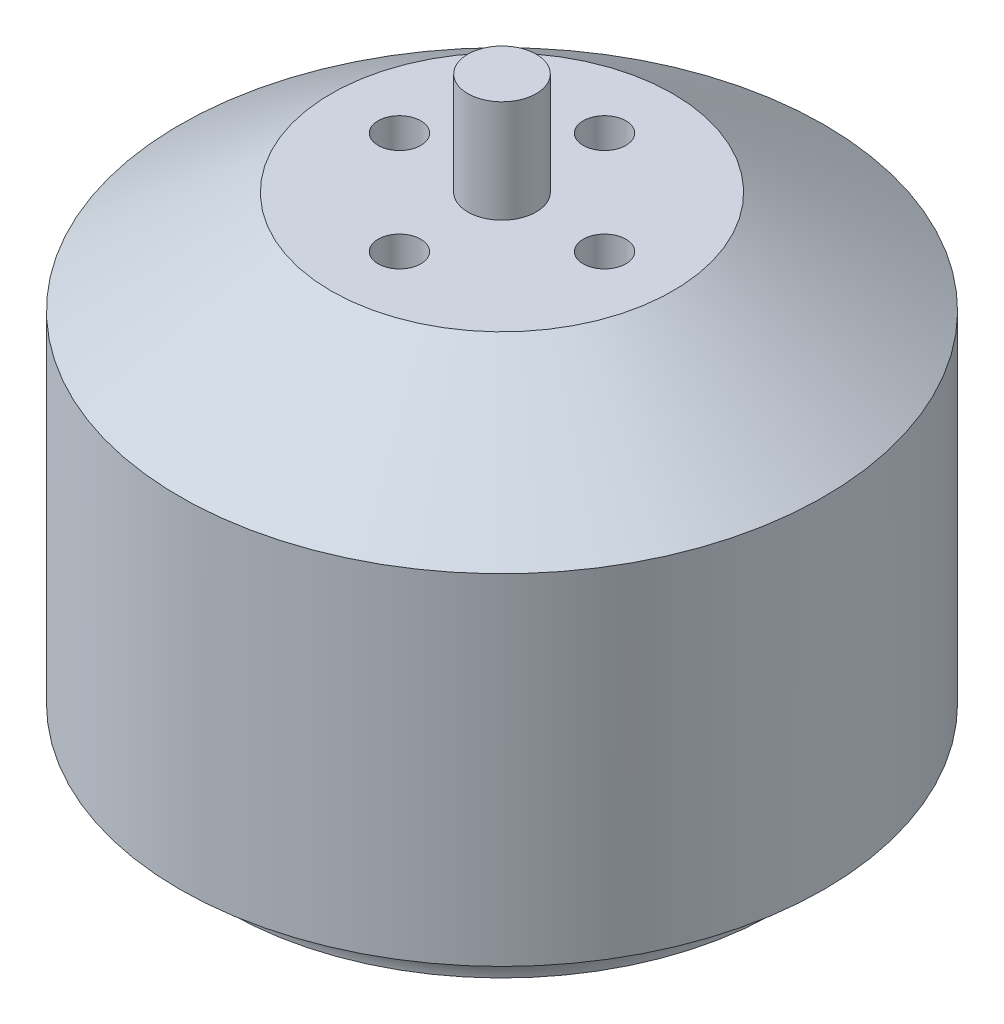
ISO-10303-21;
HEADER;
FILE_DESCRIPTION(('STEP AP214'),'2;1');
FILE_NAME('part.step','',(''),(''),'','','');
FILE_SCHEMA(('AUTOMOTIVE_DESIGN { 1 0 10303 214 1 1 1 1 }'));
ENDSEC;
DATA;
#1=APPLICATION_CONTEXT('core data for automotive mechanical design processes');
#2=APPLICATION_PROTOCOL_DEFINITION('international standard','automotive_design',2000,#1);
#3=PRODUCT_CONTEXT('',#1,'mechanical');
#4=PRODUCT('Part','Part','',(#3));
#5=PRODUCT_RELATED_PRODUCT_CATEGORY('part','',(#4));
#6=PRODUCT_DEFINITION_FORMATION('','',#4);
#7=PRODUCT_DEFINITION_CONTEXT('part definition',#1,'design');
#8=PRODUCT_DEFINITION('design','',#6,#7);
#9=PRODUCT_DEFINITION_SHAPE('','',#8);
#10=(LENGTH_UNIT() NAMED_UNIT(*) SI_UNIT(.MILLI.,.METRE.));
#11=(NAMED_UNIT(*) PLANE_ANGLE_UNIT() SI_UNIT($,.RADIAN.));
#12=(NAMED_UNIT(*) SI_UNIT($,.STERADIAN.) SOLID_ANGLE_UNIT());
#13=UNCERTAINTY_MEASURE_WITH_UNIT(LENGTH_MEASURE(1.E-05),#10,'distance_accuracy_value','');
#14=(GEOMETRIC_REPRESENTATION_CONTEXT(3) GLOBAL_UNCERTAINTY_ASSIGNED_CONTEXT((#13)) GLOBAL_UNIT_ASSIGNED_CONTEXT((#10,
#11,#12)) REPRESENTATION_CONTEXT('',''));
#15=CARTESIAN_POINT('',(0.,0.,0.));
#16=DIRECTION('',(0.,0.,1.));
#17=DIRECTION('',(1.,0.,0.));
#18=AXIS2_PLACEMENT_3D('',#15,#16,#17);
#19=CARTESIAN_POINT('',(0.,0.,0.));
#20=DIRECTION('',(0.,1.,0.));
#21=DIRECTION('',(0.,0.,1.));
#22=AXIS2_PLACEMENT_3D('',#19,#20,#21);
#23=PLANE('',#22);
#24=CARTESIAN_POINT('',(0.,0.,0.));
#25=DIRECTION('',(0.,1.,0.));
#26=DIRECTION('',(0.,0.,1.));
#27=AXIS2_PLACEMENT_3D('',#24,#25,#26);
#28=CIRCLE('',#27,16.);
#29=CARTESIAN_POINT('',(0.,0.,16.));
#30=VERTEX_POINT('',#29);
#31=EDGE_CURVE('E122',#30,#30,#28,.T.);
#32=ORIENTED_EDGE('',*,*,#31,.F.);
#33=EDGE_LOOP('',(#32));
#34=FACE_BOUND('',#33,.T.);
#35=CARTESIAN_POINT('',(0.,0.,9.5));
#36=DIRECTION('',(0.,-1.,0.));
#37=DIRECTION('',(0.,0.,-1.));
#38=AXIS2_PLACEMENT_3D('',#35,#36,#37);
#39=CIRCLE('',#38,1.24999999999999);
#40=CARTESIAN_POINT('',(0.,0.,8.25000000000001));
#41=VERTEX_POINT('',#40);
#42=EDGE_CURVE('E125',#41,#41,#39,.T.);
#43=ORIENTED_EDGE('',*,*,#42,.F.);
#44=EDGE_LOOP('',(#43));
#45=FACE_BOUND('',#44,.T.);
#46=CARTESIAN_POINT('',(12.5,0.,0.));
#47=DIRECTION('',(0.,-1.,0.));
#48=DIRECTION('',(0.,0.,-1.));
#49=AXIS2_PLACEMENT_3D('',#46,#47,#48);
#50=CIRCLE('',#49,1.24999999999999);
#51=CARTESIAN_POINT('',(12.5,0.,-1.24999999999999));
#52=VERTEX_POINT('',#51);
#53=EDGE_CURVE('E141',#52,#52,#50,.T.);
#54=ORIENTED_EDGE('',*,*,#53,.F.);
#55=EDGE_LOOP('',(#54));
#56=FACE_BOUND('',#55,.T.);
#57=CARTESIAN_POINT('',(0.,0.,-9.5));
#58=DIRECTION('',(0.,-1.,0.));
#59=DIRECTION('',(0.,0.,-1.));
#60=AXIS2_PLACEMENT_3D('',#57,#58,#59);
#61=CIRCLE('',#60,1.24999999999999);
#62=CARTESIAN_POINT('',(0.,0.,-10.75));
#63=VERTEX_POINT('',#62);
#64=EDGE_CURVE('E147',#63,#63,#61,.T.);
#65=ORIENTED_EDGE('',*,*,#64,.F.);
#66=EDGE_LOOP('',(#65));
#67=FACE_BOUND('',#66,.T.);
#68=CARTESIAN_POINT('',(-8.,0.,0.));
#69=DIRECTION('',(0.,-1.,0.));
#70=DIRECTION('',(0.,0.,-1.));
#71=AXIS2_PLACEMENT_3D('',#68,#69,#70);
#72=CIRCLE('',#71,1.24999999999999);
#73=CARTESIAN_POINT('',(-8.,0.,-1.24999999999999));
#74=VERTEX_POINT('',#73);
#75=EDGE_CURVE('E153',#74,#74,#72,.T.);
#76=ORIENTED_EDGE('',*,*,#75,.F.);
#77=EDGE_LOOP('',(#76));
#78=FACE_BOUND('',#77,.T.);
#79=CARTESIAN_POINT('',(-12.5,0.,0.));
#80=DIRECTION('',(0.,-1.,0.));
#81=DIRECTION('',(0.,0.,-1.));
#82=AXIS2_PLACEMENT_3D('',#79,#80,#81);
#83=CIRCLE('',#82,1.24999999999999);
#84=CARTESIAN_POINT('',(-12.5,0.,-1.24999999999999));
#85=VERTEX_POINT('',#84);
#86=EDGE_CURVE('E159',#85,#85,#83,.T.);
#87=ORIENTED_EDGE('',*,*,#86,.F.);
#88=EDGE_LOOP('',(#87));
#89=FACE_BOUND('',#88,.T.);
#90=CARTESIAN_POINT('',(0.,0.,0.));
#91=DIRECTION('',(0.,1.,0.));
#92=DIRECTION('',(0.,0.,1.));
#93=AXIS2_PLACEMENT_3D('',#90,#91,#92);
#94=CIRCLE('',#93,2.);
#95=CARTESIAN_POINT('',(0.,0.,2.));
#96=VERTEX_POINT('',#95);
#97=EDGE_CURVE('E11',#96,#96,#94,.F.);
#98=ORIENTED_EDGE('',*,*,#97,.F.);
#99=EDGE_LOOP('',(#98));
#100=FACE_BOUND('',#99,.T.);
#101=CARTESIAN_POINT('',(8.,0.,0.));
#102=DIRECTION('',(0.,-1.,0.));
#103=DIRECTION('',(0.,0.,-1.));
#104=AXIS2_PLACEMENT_3D('',#101,#102,#103);
#105=CIRCLE('',#104,1.24999999999999);
#106=CARTESIAN_POINT('',(8.,0.,-1.24999999999999));
#107=VERTEX_POINT('',#106);
#108=EDGE_CURVE('E135',#107,#107,#105,.T.);
#109=ORIENTED_EDGE('',*,*,#108,.F.);
#110=EDGE_LOOP('',(#109));
#111=FACE_BOUND('',#110,.T.);
#112=ADVANCED_FACE('F45',(#34,#45,#56,#67,#78,#89,#100,#111),#23,.F.);
#113=CARTESIAN_POINT('',(0.,-2.6,0.));
#114=DIRECTION('',(0.,1.,0.));
#115=DIRECTION('',(0.,0.,1.));
#116=AXIS2_PLACEMENT_3D('',#113,#114,#115);
#117=CYLINDRICAL_SURFACE('',#116,2.);
#118=CARTESIAN_POINT('',(0.,-2.6,0.));
#119=DIRECTION('',(0.,-1.,0.));
#120=DIRECTION('',(0.,0.,-1.));
#121=AXIS2_PLACEMENT_3D('',#118,#119,#120);
#122=CIRCLE('',#121,2.);
#123=CARTESIAN_POINT('',(0.,-2.6,-2.));
#124=VERTEX_POINT('',#123);
#125=EDGE_CURVE('E165',#124,#124,#122,.T.);
#126=ORIENTED_EDGE('',*,*,#125,.F.);
#127=EDGE_LOOP('',(#126));
#128=FACE_BOUND('',#127,.T.);
#129=ORIENTED_EDGE('',*,*,#97,.T.);
#130=EDGE_LOOP('',(#129));
#131=FACE_BOUND('',#130,.T.);
#132=ADVANCED_FACE('F203',(#128,#131),#117,.T.);
#133=CARTESIAN_POINT('',(0.,-2.6,0.));
#134=DIRECTION('',(0.,-1.,0.));
#135=DIRECTION('',(0.,0.,-1.));
#136=AXIS2_PLACEMENT_3D('',#133,#134,#135);
#137=PLANE('',#136);
#138=ORIENTED_EDGE('',*,*,#125,.T.);
#139=EDGE_LOOP('',(#138));
#140=FACE_BOUND('',#139,.T.);
#141=ADVANCED_FACE('F265',(#140),#137,.T.);
#142=CARTESIAN_POINT('',(-12.5,1.64892422621555,0.));
#143=DIRECTION('',(0.,-1.,0.));
#144=DIRECTION('',(0.,0.,-1.));
#145=AXIS2_PLACEMENT_3D('',#142,#143,#144);
#146=CONICAL_SURFACE('',#145,1.25,1.02974425867665);
#147=CARTESIAN_POINT('',(-12.5,2.4,0.));
#148=VERTEX_POINT('',#147);
#149=VERTEX_LOOP('',#148);
#150=FACE_BOUND('',#149,.T.);
#151=CARTESIAN_POINT('',(-12.5,1.64892422621555,0.));
#152=DIRECTION('',(0.,-1.,0.));
#153=DIRECTION('',(0.,0.,-1.));
#154=AXIS2_PLACEMENT_3D('',#151,#152,#153);
#155=CIRCLE('',#154,1.25);
#156=CARTESIAN_POINT('',(-12.5,1.64892422621555,-1.25));
#157=VERTEX_POINT('',#156);
#158=EDGE_CURVE('E162',#157,#157,#155,.T.);
#159=ORIENTED_EDGE('',*,*,#158,.T.);
#160=EDGE_LOOP('',(#159));
#161=FACE_BOUND('',#160,.T.);
#162=ADVANCED_FACE('F261',(#150,#161),#146,.F.);
#163=CARTESIAN_POINT('',(-12.5,0.,0.));
#164=DIRECTION('',(0.,-1.,0.));
#165=DIRECTION('',(0.,0.,-1.));
#166=AXIS2_PLACEMENT_3D('',#163,#164,#165);
#167=CYLINDRICAL_SURFACE('',#166,1.24999999999999);
#168=ORIENTED_EDGE('',*,*,#158,.F.);
#169=EDGE_LOOP('',(#168));
#170=FACE_BOUND('',#169,.T.);
#171=ORIENTED_EDGE('',*,*,#86,.T.);
#172=EDGE_LOOP('',(#171));
#173=FACE_BOUND('',#172,.T.);
#174=ADVANCED_FACE('F258',(#170,#173),#167,.F.);
#175=CARTESIAN_POINT('',(-8.,1.64892422621555,0.));
#176=DIRECTION('',(0.,-1.,0.));
#177=DIRECTION('',(0.,0.,-1.));
#178=AXIS2_PLACEMENT_3D('',#175,#176,#177);
#179=CONICAL_SURFACE('',#178,1.25,1.02974425867665);
#180=CARTESIAN_POINT('',(-8.,2.4,0.));
#181=VERTEX_POINT('',#180);
#182=VERTEX_LOOP('',#181);
#183=FACE_BOUND('',#182,.T.);
#184=CARTESIAN_POINT('',(-8.,1.64892422621555,0.));
#185=DIRECTION('',(0.,-1.,0.));
#186=DIRECTION('',(0.,0.,-1.));
#187=AXIS2_PLACEMENT_3D('',#184,#185,#186);
#188=CIRCLE('',#187,1.25);
#189=CARTESIAN_POINT('',(-8.,1.64892422621555,-1.25));
#190=VERTEX_POINT('',#189);
#191=EDGE_CURVE('E156',#190,#190,#188,.T.);
#192=ORIENTED_EDGE('',*,*,#191,.T.);
#193=EDGE_LOOP('',(#192));
#194=FACE_BOUND('',#193,.T.);
#195=ADVANCED_FACE('F254',(#183,#194),#179,.F.);
#196=CARTESIAN_POINT('',(-8.,0.,0.));
#197=DIRECTION('',(0.,-1.,0.));
#198=DIRECTION('',(0.,0.,-1.));
#199=AXIS2_PLACEMENT_3D('',#196,#197,#198);
#200=CYLINDRICAL_SURFACE('',#199,1.24999999999999);
#201=ORIENTED_EDGE('',*,*,#191,.F.);
#202=EDGE_LOOP('',(#201));
#203=FACE_BOUND('',#202,.T.);
#204=ORIENTED_EDGE('',*,*,#75,.T.);
#205=EDGE_LOOP('',(#204));
#206=FACE_BOUND('',#205,.T.);
#207=ADVANCED_FACE('F250',(#203,#206),#200,.F.);
#208=CARTESIAN_POINT('',(0.,1.64892422621555,-9.5));
#209=DIRECTION('',(0.,-1.,0.));
#210=DIRECTION('',(0.,0.,-1.));
#211=AXIS2_PLACEMENT_3D('',#208,#209,#210);
#212=CONICAL_SURFACE('',#211,1.25,1.02974425867665);
#213=CARTESIAN_POINT('',(0.,2.4,-9.5));
#214=VERTEX_POINT('',#213);
#215=VERTEX_LOOP('',#214);
#216=FACE_BOUND('',#215,.T.);
#217=CARTESIAN_POINT('',(0.,1.64892422621555,-9.5));
#218=DIRECTION('',(0.,-1.,0.));
#219=DIRECTION('',(0.,0.,-1.));
#220=AXIS2_PLACEMENT_3D('',#217,#218,#219);
#221=CIRCLE('',#220,1.25);
#222=CARTESIAN_POINT('',(0.,1.64892422621555,-10.75));
#223=VERTEX_POINT('',#222);
#224=EDGE_CURVE('E150',#223,#223,#221,.T.);
#225=ORIENTED_EDGE('',*,*,#224,.T.);
#226=EDGE_LOOP('',(#225));
#227=FACE_BOUND('',#226,.T.);
#228=ADVANCED_FACE('F246',(#216,#227),#212,.F.);
#229=CARTESIAN_POINT('',(0.,0.,-9.5));
#230=DIRECTION('',(0.,-1.,0.));
#231=DIRECTION('',(0.,0.,-1.));
#232=AXIS2_PLACEMENT_3D('',#229,#230,#231);
#233=CYLINDRICAL_SURFACE('',#232,1.24999999999999);
#234=ORIENTED_EDGE('',*,*,#224,.F.);
#235=EDGE_LOOP('',(#234));
#236=FACE_BOUND('',#235,.T.);
#237=ORIENTED_EDGE('',*,*,#64,.T.);
#238=EDGE_LOOP('',(#237));
#239=FACE_BOUND('',#238,.T.);
#240=ADVANCED_FACE('F242',(#236,#239),#233,.F.);
#241=CARTESIAN_POINT('',(12.5,1.64892422621555,0.));
#242=DIRECTION('',(0.,-1.,0.));
#243=DIRECTION('',(0.,0.,-1.));
#244=AXIS2_PLACEMENT_3D('',#241,#242,#243);
#245=CONICAL_SURFACE('',#244,1.25,1.02974425867665);
#246=CARTESIAN_POINT('',(12.5,2.4,0.));
#247=VERTEX_POINT('',#246);
#248=VERTEX_LOOP('',#247);
#249=FACE_BOUND('',#248,.T.);
#250=CARTESIAN_POINT('',(12.5,1.64892422621555,0.));
#251=DIRECTION('',(0.,-1.,0.));
#252=DIRECTION('',(0.,0.,-1.));
#253=AXIS2_PLACEMENT_3D('',#250,#251,#252);
#254=CIRCLE('',#253,1.25);
#255=CARTESIAN_POINT('',(12.5,1.64892422621555,-1.25));
#256=VERTEX_POINT('',#255);
#257=EDGE_CURVE('E144',#256,#256,#254,.T.);
#258=ORIENTED_EDGE('',*,*,#257,.T.);
#259=EDGE_LOOP('',(#258));
#260=FACE_BOUND('',#259,.T.);
#261=ADVANCED_FACE('F238',(#249,#260),#245,.F.);
#262=CARTESIAN_POINT('',(12.5,0.,0.));
#263=DIRECTION('',(0.,-1.,0.));
#264=DIRECTION('',(0.,0.,-1.));
#265=AXIS2_PLACEMENT_3D('',#262,#263,#264);
#266=CYLINDRICAL_SURFACE('',#265,1.24999999999999);
#267=ORIENTED_EDGE('',*,*,#257,.F.);
#268=EDGE_LOOP('',(#267));
#269=FACE_BOUND('',#268,.T.);
#270=ORIENTED_EDGE('',*,*,#53,.T.);
#271=EDGE_LOOP('',(#270));
#272=FACE_BOUND('',#271,.T.);
#273=ADVANCED_FACE('F230',(#269,#272),#266,.F.);
#274=CARTESIAN_POINT('',(8.,1.64892422621555,0.));
#275=DIRECTION('',(0.,-1.,0.));
#276=DIRECTION('',(0.,0.,-1.));
#277=AXIS2_PLACEMENT_3D('',#274,#275,#276);
#278=CONICAL_SURFACE('',#277,1.25,1.02974425867665);
#279=CARTESIAN_POINT('',(8.,2.4,0.));
#280=VERTEX_POINT('',#279);
#281=VERTEX_LOOP('',#280);
#282=FACE_BOUND('',#281,.T.);
#283=CARTESIAN_POINT('',(8.,1.64892422621555,0.));
#284=DIRECTION('',(0.,-1.,0.));
#285=DIRECTION('',(0.,0.,-1.));
#286=AXIS2_PLACEMENT_3D('',#283,#284,#285);
#287=CIRCLE('',#286,1.25);
#288=CARTESIAN_POINT('',(8.,1.64892422621555,-1.25));
#289=VERTEX_POINT('',#288);
#290=EDGE_CURVE('E138',#289,#289,#287,.T.);
#291=ORIENTED_EDGE('',*,*,#290,.T.);
#292=EDGE_LOOP('',(#291));
#293=FACE_BOUND('',#292,.T.);
#294=ADVANCED_FACE('F221',(#282,#293),#278,.F.);
#295=CARTESIAN_POINT('',(8.,0.,0.));
#296=DIRECTION('',(0.,-1.,0.));
#297=DIRECTION('',(0.,0.,-1.));
#298=AXIS2_PLACEMENT_3D('',#295,#296,#297);
#299=CYLINDRICAL_SURFACE('',#298,1.24999999999999);
#300=ORIENTED_EDGE('',*,*,#290,.F.);
#301=EDGE_LOOP('',(#300));
#302=FACE_BOUND('',#301,.T.);
#303=ORIENTED_EDGE('',*,*,#108,.T.);
#304=EDGE_LOOP('',(#303));
#305=FACE_BOUND('',#304,.T.);
#306=ADVANCED_FACE('F218',(#302,#305),#299,.F.);
#307=CARTESIAN_POINT('',(0.,1.64892422621555,9.5));
#308=DIRECTION('',(0.,-1.,0.));
#309=DIRECTION('',(0.,0.,-1.));
#310=AXIS2_PLACEMENT_3D('',#307,#308,#309);
#311=CONICAL_SURFACE('',#310,1.25,1.02974425867665);
#312=CARTESIAN_POINT('',(0.,2.4,9.5));
#313=VERTEX_POINT('',#312);
#314=VERTEX_LOOP('',#313);
#315=FACE_BOUND('',#314,.T.);
#316=CARTESIAN_POINT('',(0.,1.64892422621555,9.5));
#317=DIRECTION('',(0.,-1.,0.));
#318=DIRECTION('',(0.,0.,-1.));
#319=AXIS2_PLACEMENT_3D('',#316,#317,#318);
#320=CIRCLE('',#319,1.25);
#321=CARTESIAN_POINT('',(0.,1.64892422621555,8.25));
#322=VERTEX_POINT('',#321);
#323=EDGE_CURVE('E132',#322,#322,#320,.T.);
#324=ORIENTED_EDGE('',*,*,#323,.T.);
#325=EDGE_LOOP('',(#324));
#326=FACE_BOUND('',#325,.T.);
#327=ADVANCED_FACE('F220',(#315,#326),#311,.F.);
#328=CARTESIAN_POINT('',(0.,0.,9.5));
#329=DIRECTION('',(0.,-1.,0.));
#330=DIRECTION('',(0.,0.,-1.));
#331=AXIS2_PLACEMENT_3D('',#328,#329,#330);
#332=CYLINDRICAL_SURFACE('',#331,1.24999999999999);
#333=ORIENTED_EDGE('',*,*,#323,.F.);
#334=EDGE_LOOP('',(#333));
#335=FACE_BOUND('',#334,.T.);
#336=ORIENTED_EDGE('',*,*,#42,.T.);
#337=EDGE_LOOP('',(#336));
#338=FACE_BOUND('',#337,.T.);
#339=ADVANCED_FACE('F197',(#335,#338),#332,.F.);
#340=CARTESIAN_POINT('',(0.,-0.262019230769191,0.));
#341=DIRECTION('',(0.,1.,0.));
#342=DIRECTION('',(0.,0.,1.));
#343=AXIS2_PLACEMENT_3D('',#340,#341,#342);
#344=TOROIDAL_SURFACE('',#343,18.85,2.8620192307692);
#345=CARTESIAN_POINT('',(0.,2.60000000000002,0.));
#346=DIRECTION('',(0.,1.,0.));
#347=DIRECTION('',(0.,0.,1.));
#348=AXIS2_PLACEMENT_3D('',#345,#346,#347);
#349=CIRCLE('',#348,18.85);
#350=CARTESIAN_POINT('',(0.,2.60000000000001,-18.85));
#351=VERTEX_POINT('',#350);
#352=EDGE_CURVE('E117',#351,#351,#349,.T.);
#353=ORIENTED_EDGE('',*,*,#352,.F.);
#354=EDGE_LOOP('',(#353));
#355=FACE_BOUND('',#354,.T.);
#356=ORIENTED_EDGE('',*,*,#31,.T.);
#357=EDGE_LOOP('',(#356));
#358=FACE_BOUND('',#357,.T.);
#359=ADVANCED_FACE('F192',(#355,#358),#344,.F.);
#360=CARTESIAN_POINT('',(0.,28.5,0.));
#361=DIRECTION('',(0.,-1.,0.));
#362=DIRECTION('',(0.,0.,-1.));
#363=AXIS2_PLACEMENT_3D('',#360,#361,#362);
#364=CYLINDRICAL_SURFACE('',#363,18.85);
#365=CARTESIAN_POINT('',(0.,22.5,0.));
#366=DIRECTION('',(0.,1.,0.));
#367=DIRECTION('',(0.,0.,1.));
#368=AXIS2_PLACEMENT_3D('',#365,#366,#367);
#369=CIRCLE('',#368,18.85);
#370=CARTESIAN_POINT('',(0.,22.5,-18.85));
#371=VERTEX_POINT('',#370);
#372=EDGE_CURVE('E118',#371,#371,#369,.T.);
#373=CARTESIAN_POINT('',(0.,22.5,-18.85));
#374=CARTESIAN_POINT('',(0.,22.2927083333333,-18.85));
#375=CARTESIAN_POINT('',(0.,22.0854166666667,-18.85));
#376=CARTESIAN_POINT('',(0.,21.6708333333333,-18.85));
#377=CARTESIAN_POINT('',(0.,21.4635416666667,-18.85));
#378=CARTESIAN_POINT('',(0.,21.0489583333333,-18.85));
#379=CARTESIAN_POINT('',(0.,20.8416666666667,-18.85));
#380=CARTESIAN_POINT('',(0.,20.4270833333333,-18.85));
#381=CARTESIAN_POINT('',(0.,20.2197916666667,-18.85));
#382=CARTESIAN_POINT('',(0.,19.8052083333333,-18.85));
#383=CARTESIAN_POINT('',(0.,19.5979166666667,-18.85));
#384=CARTESIAN_POINT('',(0.,19.1833333333333,-18.85));
#385=CARTESIAN_POINT('',(0.,18.9760416666667,-18.85));
#386=CARTESIAN_POINT('',(0.,18.5614583333333,-18.85));
#387=CARTESIAN_POINT('',(0.,18.3541666666667,-18.85));
#388=CARTESIAN_POINT('',(0.,17.9395833333333,-18.85));
#389=CARTESIAN_POINT('',(0.,17.7322916666667,-18.85));
#390=CARTESIAN_POINT('',(0.,17.3177083333333,-18.85));
#391=CARTESIAN_POINT('',(0.,17.1104166666667,-18.85));
#392=CARTESIAN_POINT('',(0.,16.6958333333333,-18.85));
#393=CARTESIAN_POINT('',(0.,16.4885416666667,-18.85));
#394=CARTESIAN_POINT('',(0.,16.0739583333333,-18.85));
#395=CARTESIAN_POINT('',(0.,15.8666666666667,-18.85));
#396=CARTESIAN_POINT('',(0.,15.4520833333333,-18.85));
#397=CARTESIAN_POINT('',(0.,15.2447916666667,-18.85));
#398=CARTESIAN_POINT('',(0.,14.8302083333333,-18.85));
#399=CARTESIAN_POINT('',(0.,14.6229166666667,-18.85));
#400=CARTESIAN_POINT('',(0.,14.2083333333333,-18.85));
#401=CARTESIAN_POINT('',(0.,14.0010416666667,-18.85));
#402=CARTESIAN_POINT('',(0.,13.5864583333333,-18.85));
#403=CARTESIAN_POINT('',(0.,13.3791666666667,-18.85));
#404=CARTESIAN_POINT('',(0.,12.9645833333333,-18.85));
#405=CARTESIAN_POINT('',(0.,12.7572916666667,-18.85));
#406=CARTESIAN_POINT('',(0.,12.3427083333333,-18.85));
#407=CARTESIAN_POINT('',(0.,12.1354166666667,-18.85));
#408=CARTESIAN_POINT('',(0.,11.7208333333333,-18.85));
#409=CARTESIAN_POINT('',(0.,11.5135416666667,-18.85));
#410=CARTESIAN_POINT('',(0.,11.0989583333333,-18.85));
#411=CARTESIAN_POINT('',(0.,10.8916666666667,-18.85));
#412=CARTESIAN_POINT('',(0.,10.4770833333333,-18.85));
#413=CARTESIAN_POINT('',(0.,10.2697916666667,-18.85));
#414=CARTESIAN_POINT('',(0.,9.85520833333334,-18.85));
#415=CARTESIAN_POINT('',(0.,9.64791666666667,-18.85));
#416=CARTESIAN_POINT('',(0.,9.23333333333334,-18.85));
#417=CARTESIAN_POINT('',(0.,9.02604166666667,-18.85));
#418=CARTESIAN_POINT('',(0.,8.61145833333334,-18.85));
#419=CARTESIAN_POINT('',(0.,8.40416666666667,-18.85));
#420=CARTESIAN_POINT('',(0.,7.98958333333334,-18.85));
#421=CARTESIAN_POINT('',(0.,7.78229166666667,-18.85));
#422=CARTESIAN_POINT('',(0.,7.36770833333334,-18.85));
#423=CARTESIAN_POINT('',(0.,7.16041666666668,-18.85));
#424=CARTESIAN_POINT('',(0.,6.74583333333334,-18.85));
#425=CARTESIAN_POINT('',(0.,6.53854166666668,-18.85));
#426=CARTESIAN_POINT('',(0.,6.12395833333334,-18.85));
#427=CARTESIAN_POINT('',(0.,5.91666666666668,-18.85));
#428=CARTESIAN_POINT('',(0.,5.50208333333334,-18.85));
#429=CARTESIAN_POINT('',(0.,5.29479166666668,-18.85));
#430=CARTESIAN_POINT('',(0.,4.88020833333334,-18.85));
#431=CARTESIAN_POINT('',(0.,4.67291666666668,-18.85));
#432=CARTESIAN_POINT('',(0.,4.25833333333334,-18.85));
#433=CARTESIAN_POINT('',(0.,4.05104166666668,-18.85));
#434=CARTESIAN_POINT('',(0.,3.63645833333334,-18.85));
#435=CARTESIAN_POINT('',(0.,3.42916666666668,-18.85));
#436=CARTESIAN_POINT('',(0.,3.01458333333335,-18.85));
#437=CARTESIAN_POINT('',(0.,2.80729166666668,-18.85));
#438=CARTESIAN_POINT('',(0.,2.60000000000001,-18.85));
#439=B_SPLINE_CURVE_WITH_KNOTS('',3,(#373,#374,#375,#376,#377,#378,#379,#380,#381,#382,#383,
#384,#385,#386,#387,#388,#389,#390,#391,#392,#393,#394,#395,#396,#397,#398,#399,#400,#401,#402,
#403,#404,#405,#406,#407,#408,#409,#410,#411,#412,#413,#414,#415,#416,#417,#418,#419,#420,#421,
#422,#423,#424,#425,#426,#427,#428,#429,#430,#431,#432,#433,#434,#435,#436,#437,#438),
.UNSPECIFIED.,.F.,.F.,(4,2,2,2,2,2,2,2,2,2,2,2,2,2,2,2,2,2,2,2,2,2,2,2,2,2,2,2,2,2,2,2,4),(0.,
0.621874999999997,1.24375,1.865625,2.4875,3.10937499999999,3.73124999999999,4.353125,4.975,
5.59687499999999,6.21874999999999,6.84062499999999,7.46249999999999,8.08437499999999,
8.70624999999999,9.32812499999999,9.94999999999999,10.571875,11.19375,11.815625,12.4375,
13.059375,13.68125,14.303125,14.925,15.546875,16.16875,16.790625,17.4125,18.034375,18.65625,
19.278125,19.9),.UNSPECIFIED.);
#440=EDGE_CURVE('BSEAM47',#371,#351,#439,.T.);
#441=ORIENTED_EDGE('',*,*,#372,.F.);
#442=ORIENTED_EDGE('',*,*,#352,.T.);
#443=ORIENTED_EDGE('',*,*,#440,.T.);
#444=ORIENTED_EDGE('',*,*,#440,.F.);
#445=EDGE_LOOP('',(#441,#443,#442,#444));
#446=FACE_BOUND('',#445,.T.);
#447=ADVANCED_FACE('F47',(#446),#364,.T.);
#448=CARTESIAN_POINT('',(0.,22.5,0.));
#449=DIRECTION('',(0.,-1.,0.));
#450=DIRECTION('',(0.,0.,-1.));
#451=AXIS2_PLACEMENT_3D('',#448,#449,#450);
#452=CONICAL_SURFACE('',#451,18.85,0.975011779171836);
#453=CARTESIAN_POINT('',(0.,28.5,0.));
#454=DIRECTION('',(0.,1.,0.));
#455=DIRECTION('',(0.,0.,1.));
#456=AXIS2_PLACEMENT_3D('',#453,#454,#455);
#457=CIRCLE('',#456,10.);
#458=CARTESIAN_POINT('',(0.,28.5,10.));
#459=VERTEX_POINT('',#458);
#460=EDGE_CURVE('E121',#459,#459,#457,.T.);
#461=ORIENTED_EDGE('',*,*,#460,.F.);
#462=EDGE_LOOP('',(#461));
#463=FACE_BOUND('',#462,.T.);
#464=ORIENTED_EDGE('',*,*,#372,.T.);
#465=EDGE_LOOP('',(#464));
#466=FACE_BOUND('',#465,.T.);
#467=ADVANCED_FACE('F183',(#463,#466),#452,.T.);
#468=CARTESIAN_POINT('',(0.,34.5,0.));
#469=DIRECTION('',(0.,1.,0.));
#470=DIRECTION('',(0.,0.,1.));
#471=AXIS2_PLACEMENT_3D('',#468,#469,#470);
#472=PLANE('',#471);
#473=CARTESIAN_POINT('',(0.,34.5,0.));
#474=DIRECTION('',(0.,1.,0.));
#475=DIRECTION('',(0.,0.,1.));
#476=AXIS2_PLACEMENT_3D('',#473,#474,#475);
#477=CIRCLE('',#476,2.);
#478=CARTESIAN_POINT('',(0.,34.5,2.));
#479=VERTEX_POINT('',#478);
#480=EDGE_CURVE('E53',#479,#479,#477,.T.);
#481=ORIENTED_EDGE('',*,*,#480,.T.);
#482=EDGE_LOOP('',(#481));
#483=FACE_BOUND('',#482,.T.);
#484=ADVANCED_FACE('F186',(#483),#472,.T.);
#485=CARTESIAN_POINT('',(0.,34.5,0.));
#486=DIRECTION('',(0.,-1.,0.));
#487=DIRECTION('',(0.,0.,-1.));
#488=AXIS2_PLACEMENT_3D('',#485,#486,#487);
#489=CYLINDRICAL_SURFACE('',#488,2.);
#490=ORIENTED_EDGE('',*,*,#480,.F.);
#491=EDGE_LOOP('',(#490));
#492=FACE_BOUND('',#491,.T.);
#493=CARTESIAN_POINT('',(0.,28.5,0.));
#494=DIRECTION('',(0.,1.,0.));
#495=DIRECTION('',(0.,0.,1.));
#496=AXIS2_PLACEMENT_3D('',#493,#494,#495);
#497=CIRCLE('',#496,2.);
#498=CARTESIAN_POINT('',(0.,28.5,2.));
#499=VERTEX_POINT('',#498);
#500=EDGE_CURVE('E168',#499,#499,#497,.T.);
#501=ORIENTED_EDGE('',*,*,#500,.T.);
#502=EDGE_LOOP('',(#501));
#503=FACE_BOUND('',#502,.T.);
#504=ADVANCED_FACE('F173',(#492,#503),#489,.T.);
#505=CARTESIAN_POINT('',(0.,28.5,0.));
#506=DIRECTION('',(0.,1.,0.));
#507=DIRECTION('',(0.,0.,1.));
#508=AXIS2_PLACEMENT_3D('',#505,#506,#507);
#509=PLANE('',#508);
#510=CARTESIAN_POINT('',(0.,28.5,-6.));
#511=DIRECTION('',(0.,1.,0.));
#512=DIRECTION('',(0.,0.,1.));
#513=AXIS2_PLACEMENT_3D('',#510,#511,#512);
#514=CIRCLE('',#513,1.24999999999999);
#515=CARTESIAN_POINT('',(0.,28.5,-4.75000000000001));
#516=VERTEX_POINT('',#515);
#517=EDGE_CURVE('E95',#516,#516,#514,.T.);
#518=ORIENTED_EDGE('',*,*,#517,.F.);
#519=EDGE_LOOP('',(#518));
#520=FACE_BOUND('',#519,.T.);
#521=CARTESIAN_POINT('',(6.,28.5,0.));
#522=DIRECTION('',(0.,1.,0.));
#523=DIRECTION('',(0.,0.,1.));
#524=AXIS2_PLACEMENT_3D('',#521,#522,#523);
#525=CIRCLE('',#524,1.24999999999999);
#526=CARTESIAN_POINT('',(6.,28.5,1.25000000000001));
#527=VERTEX_POINT('',#526);
#528=EDGE_CURVE('E94',#527,#527,#525,.T.);
#529=ORIENTED_EDGE('',*,*,#528,.F.);
#530=EDGE_LOOP('',(#529));
#531=FACE_BOUND('',#530,.T.);
#532=CARTESIAN_POINT('',(0.,28.5,5.99999999999994));
#533=DIRECTION('',(0.,1.,0.));
#534=DIRECTION('',(0.,0.,1.));
#535=AXIS2_PLACEMENT_3D('',#532,#533,#534);
#536=CIRCLE('',#535,1.24999999999999);
#537=CARTESIAN_POINT('',(0.,28.5,7.24999999999993));
#538=VERTEX_POINT('',#537);
#539=EDGE_CURVE('E105',#538,#538,#536,.T.);
#540=ORIENTED_EDGE('',*,*,#539,.F.);
#541=EDGE_LOOP('',(#540));
#542=FACE_BOUND('',#541,.T.);
#543=CARTESIAN_POINT('',(-6.,28.5,0.));
#544=DIRECTION('',(0.,1.,0.));
#545=DIRECTION('',(0.,0.,1.));
#546=AXIS2_PLACEMENT_3D('',#543,#544,#545);
#547=CIRCLE('',#546,1.24999999999999);
#548=CARTESIAN_POINT('',(-6.,28.5,1.24999999999993));
#549=VERTEX_POINT('',#548);
#550=EDGE_CURVE('E111',#549,#549,#547,.T.);
#551=ORIENTED_EDGE('',*,*,#550,.F.);
#552=EDGE_LOOP('',(#551));
#553=FACE_BOUND('',#552,.T.);
#554=ORIENTED_EDGE('',*,*,#500,.F.);
#555=EDGE_LOOP('',(#554));
#556=FACE_BOUND('',#555,.T.);
#557=ORIENTED_EDGE('',*,*,#460,.T.);
#558=EDGE_LOOP('',(#557));
#559=FACE_BOUND('',#558,.T.);
#560=ADVANCED_FACE('F175',(#520,#531,#542,#553,#556,#559),#509,.T.);
#561=CARTESIAN_POINT('',(-6.,23.2510757737845,0.));
#562=DIRECTION('',(0.,1.,0.));
#563=DIRECTION('',(0.,0.,1.));
#564=AXIS2_PLACEMENT_3D('',#561,#562,#563);
#565=CONICAL_SURFACE('',#564,1.25,1.02974425867665);
#566=CARTESIAN_POINT('',(-6.,22.5,0.));
#567=VERTEX_POINT('',#566);
#568=VERTEX_LOOP('',#567);
#569=FACE_BOUND('',#568,.T.);
#570=CARTESIAN_POINT('',(-6.,23.2510757737845,0.));
#571=DIRECTION('',(0.,1.,0.));
#572=DIRECTION('',(0.,0.,1.));
#573=AXIS2_PLACEMENT_3D('',#570,#571,#572);
#574=CIRCLE('',#573,1.25);
#575=CARTESIAN_POINT('',(-6.,23.2510757737845,1.24999999999994));
#576=VERTEX_POINT('',#575);
#577=EDGE_CURVE('E114',#576,#576,#574,.T.);
#578=ORIENTED_EDGE('',*,*,#577,.T.);
#579=EDGE_LOOP('',(#578));
#580=FACE_BOUND('',#579,.T.);
#581=ADVANCED_FACE('F178',(#569,#580),#565,.F.);
#582=CARTESIAN_POINT('',(-6.,28.5,0.));
#583=DIRECTION('',(0.,1.,0.));
#584=DIRECTION('',(0.,0.,1.));
#585=AXIS2_PLACEMENT_3D('',#582,#583,#584);
#586=CYLINDRICAL_SURFACE('',#585,1.24999999999999);
#587=ORIENTED_EDGE('',*,*,#577,.F.);
#588=EDGE_LOOP('',(#587));
#589=FACE_BOUND('',#588,.T.);
#590=ORIENTED_EDGE('',*,*,#550,.T.);
#591=EDGE_LOOP('',(#590));
#592=FACE_BOUND('',#591,.T.);
#593=ADVANCED_FACE('F295',(#589,#592),#586,.F.);
#594=CARTESIAN_POINT('',(0.,23.2510757737845,5.99999999999994));
#595=DIRECTION('',(0.,1.,0.));
#596=DIRECTION('',(0.,0.,1.));
#597=AXIS2_PLACEMENT_3D('',#594,#595,#596);
#598=CONICAL_SURFACE('',#597,1.25,1.02974425867665);
#599=CARTESIAN_POINT('',(0.,22.5,5.99999999999994));
#600=VERTEX_POINT('',#599);
#601=VERTEX_LOOP('',#600);
#602=FACE_BOUND('',#601,.T.);
#603=CARTESIAN_POINT('',(0.,23.2510757737845,5.99999999999994));
#604=DIRECTION('',(0.,1.,0.));
#605=DIRECTION('',(0.,0.,1.));
#606=AXIS2_PLACEMENT_3D('',#603,#604,#605);
#607=CIRCLE('',#606,1.25);
#608=CARTESIAN_POINT('',(0.,23.2510757737845,7.24999999999994));
#609=VERTEX_POINT('',#608);
#610=EDGE_CURVE('E108',#609,#609,#607,.T.);
#611=ORIENTED_EDGE('',*,*,#610,.T.);
#612=EDGE_LOOP('',(#611));
#613=FACE_BOUND('',#612,.T.);
#614=ADVANCED_FACE('F304',(#602,#613),#598,.F.);
#615=CARTESIAN_POINT('',(0.,28.5,5.99999999999994));
#616=DIRECTION('',(0.,1.,0.));
#617=DIRECTION('',(0.,0.,1.));
#618=AXIS2_PLACEMENT_3D('',#615,#616,#617);
#619=CYLINDRICAL_SURFACE('',#618,1.24999999999999);
#620=ORIENTED_EDGE('',*,*,#610,.F.);
#621=EDGE_LOOP('',(#620));
#622=FACE_BOUND('',#621,.T.);
#623=ORIENTED_EDGE('',*,*,#539,.T.);
#624=EDGE_LOOP('',(#623));
#625=FACE_BOUND('',#624,.T.);
#626=ADVANCED_FACE('F312',(#622,#625),#619,.F.);
#627=CARTESIAN_POINT('',(6.,23.2510757737845,0.));
#628=DIRECTION('',(0.,1.,0.));
#629=DIRECTION('',(0.,0.,1.));
#630=AXIS2_PLACEMENT_3D('',#627,#628,#629);
#631=CONICAL_SURFACE('',#630,1.25,1.02974425867665);
#632=CARTESIAN_POINT('',(6.,22.5,0.));
#633=VERTEX_POINT('',#632);
#634=VERTEX_LOOP('',#633);
#635=FACE_BOUND('',#634,.T.);
#636=CARTESIAN_POINT('',(6.,23.2510757737845,0.));
#637=DIRECTION('',(0.,1.,0.));
#638=DIRECTION('',(0.,0.,1.));
#639=AXIS2_PLACEMENT_3D('',#636,#637,#638);
#640=CIRCLE('',#639,1.25);
#641=CARTESIAN_POINT('',(6.,23.2510757737845,1.25000000000002));
#642=VERTEX_POINT('',#641);
#643=EDGE_CURVE('E98',#642,#642,#640,.T.);
#644=ORIENTED_EDGE('',*,*,#643,.T.);
#645=EDGE_LOOP('',(#644));
#646=FACE_BOUND('',#645,.T.);
#647=ADVANCED_FACE('F321',(#635,#646),#631,.F.);
#648=CARTESIAN_POINT('',(6.,28.5,0.));
#649=DIRECTION('',(0.,1.,0.));
#650=DIRECTION('',(0.,0.,1.));
#651=AXIS2_PLACEMENT_3D('',#648,#649,#650);
#652=CYLINDRICAL_SURFACE('',#651,1.24999999999999);
#653=ORIENTED_EDGE('',*,*,#643,.F.);
#654=EDGE_LOOP('',(#653));
#655=FACE_BOUND('',#654,.T.);
#656=ORIENTED_EDGE('',*,*,#528,.T.);
#657=EDGE_LOOP('',(#656));
#658=FACE_BOUND('',#657,.T.);
#659=ADVANCED_FACE('F88',(#655,#658),#652,.F.);
#660=CARTESIAN_POINT('',(0.,23.2510757737845,-6.));
#661=DIRECTION('',(0.,1.,0.));
#662=DIRECTION('',(0.,0.,1.));
#663=AXIS2_PLACEMENT_3D('',#660,#661,#662);
#664=CONICAL_SURFACE('',#663,1.25,1.02974425867665);
#665=CARTESIAN_POINT('',(0.,22.5,-6.));
#666=VERTEX_POINT('',#665);
#667=VERTEX_LOOP('',#666);
#668=FACE_BOUND('',#667,.T.);
#669=CARTESIAN_POINT('',(0.,23.2510757737845,-6.));
#670=DIRECTION('',(0.,1.,0.));
#671=DIRECTION('',(0.,0.,1.));
#672=AXIS2_PLACEMENT_3D('',#669,#670,#671);
#673=CIRCLE('',#672,1.25);
#674=CARTESIAN_POINT('',(0.,23.2510757737845,-4.75));
#675=VERTEX_POINT('',#674);
#676=EDGE_CURVE('E92',#675,#675,#673,.T.);
#677=ORIENTED_EDGE('',*,*,#676,.T.);
#678=EDGE_LOOP('',(#677));
#679=FACE_BOUND('',#678,.T.);
#680=ADVANCED_FACE('F84',(#668,#679),#664,.F.);
#681=CARTESIAN_POINT('',(0.,28.5,-6.));
#682=DIRECTION('',(0.,1.,0.));
#683=DIRECTION('',(0.,0.,1.));
#684=AXIS2_PLACEMENT_3D('',#681,#682,#683);
#685=CYLINDRICAL_SURFACE('',#684,1.24999999999999);
#686=ORIENTED_EDGE('',*,*,#676,.F.);
#687=EDGE_LOOP('',(#686));
#688=FACE_BOUND('',#687,.T.);
#689=ORIENTED_EDGE('',*,*,#517,.T.);
#690=EDGE_LOOP('',(#689));
#691=FACE_BOUND('',#690,.T.);
#692=ADVANCED_FACE('F87',(#688,#691),#685,.F.);
#693=CLOSED_SHELL('',(#112,#132,#141,#162,#174,#195,#207,#228,#240,#261,#273,#294,#306,#327,
#339,#359,#447,#467,#484,#504,#560,#581,#593,#614,#626,#647,#659,#680,#692));
#694=MANIFOLD_SOLID_BREP('B2',#693);
#695=ADVANCED_BREP_SHAPE_REPRESENTATION('',(#18,#694),#14);
#696=SHAPE_DEFINITION_REPRESENTATION(#9,#695);
ENDSEC;
END-ISO-10303-21;
